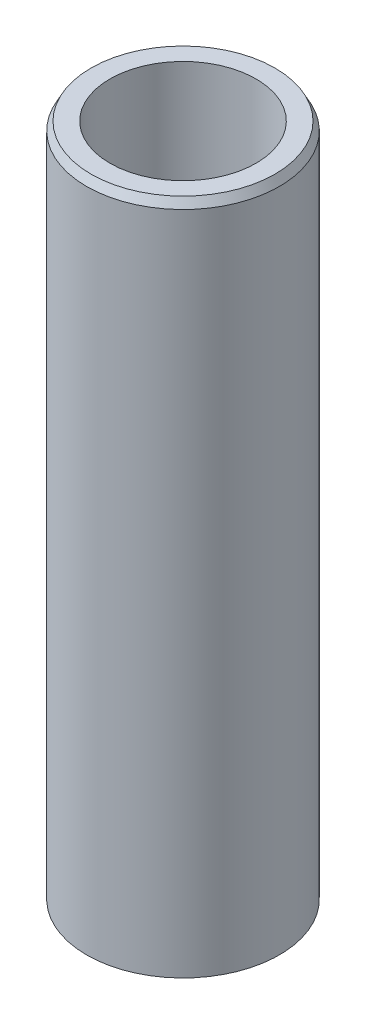
ISO-10303-21;
HEADER;
FILE_DESCRIPTION(('STEP AP214'),'2;1');
FILE_NAME('part.step','',(''),(''),'','','');
FILE_SCHEMA(('AUTOMOTIVE_DESIGN { 1 0 10303 214 1 1 1 1 }'));
ENDSEC;
DATA;
#1=APPLICATION_CONTEXT('core data for automotive mechanical design processes');
#2=APPLICATION_PROTOCOL_DEFINITION('international standard','automotive_design',2000,#1);
#3=PRODUCT_CONTEXT('',#1,'mechanical');
#4=PRODUCT('Part','Part','',(#3));
#5=PRODUCT_RELATED_PRODUCT_CATEGORY('part','',(#4));
#6=PRODUCT_DEFINITION_FORMATION('','',#4);
#7=PRODUCT_DEFINITION_CONTEXT('part definition',#1,'design');
#8=PRODUCT_DEFINITION('design','',#6,#7);
#9=PRODUCT_DEFINITION_SHAPE('','',#8);
#10=(LENGTH_UNIT() NAMED_UNIT(*) SI_UNIT(.MILLI.,.METRE.));
#11=(NAMED_UNIT(*) PLANE_ANGLE_UNIT() SI_UNIT($,.RADIAN.));
#12=(NAMED_UNIT(*) SI_UNIT($,.STERADIAN.) SOLID_ANGLE_UNIT());
#13=UNCERTAINTY_MEASURE_WITH_UNIT(LENGTH_MEASURE(1.E-05),#10,'distance_accuracy_value','');
#14=(GEOMETRIC_REPRESENTATION_CONTEXT(3) GLOBAL_UNCERTAINTY_ASSIGNED_CONTEXT((#13)) GLOBAL_UNIT_ASSIGNED_CONTEXT((#10,
#11,#12)) REPRESENTATION_CONTEXT('',''));
#15=CARTESIAN_POINT('',(0.,0.,0.));
#16=DIRECTION('',(0.,0.,1.));
#17=DIRECTION('',(1.,0.,0.));
#18=AXIS2_PLACEMENT_3D('',#15,#16,#17);
#19=CARTESIAN_POINT('',(0.,334.300783859886,0.));
#20=DIRECTION('',(0.,-1.,0.));
#21=DIRECTION('',(0.,0.,-1.));
#22=AXIS2_PLACEMENT_3D('',#19,#20,#21);
#23=CYLINDRICAL_SURFACE('',#22,47.5);
#24=CARTESIAN_POINT('',(0.,330.138083601052,0.));
#25=DIRECTION('',(0.,1.,0.));
#26=DIRECTION('',(0.,0.,1.));
#27=AXIS2_PLACEMENT_3D('',#24,#25,#26);
#28=CIRCLE('',#27,47.5);
#29=CARTESIAN_POINT('',(0.,330.138083601052,47.5));
#30=VERTEX_POINT('',#29);
#31=EDGE_CURVE('E50',#30,#30,#28,.F.);
#32=ORIENTED_EDGE('',*,*,#31,.T.);
#33=EDGE_LOOP('',(#32));
#34=FACE_BOUND('',#33,.T.);
#35=CARTESIAN_POINT('',(0.,2.18607595853532,0.));
#36=DIRECTION('',(0.,1.,0.));
#37=DIRECTION('',(0.,0.,1.));
#38=AXIS2_PLACEMENT_3D('',#35,#36,#37);
#39=CIRCLE('',#38,47.5);
#40=CARTESIAN_POINT('',(0.,2.18607595853532,47.5));
#41=VERTEX_POINT('',#40);
#42=EDGE_CURVE('E51',#41,#41,#39,.T.);
#43=ORIENTED_EDGE('',*,*,#42,.T.);
#44=EDGE_LOOP('',(#43));
#45=FACE_BOUND('',#44,.T.);
#46=ADVANCED_FACE('F39',(#34,#45),#23,.T.);
#47=CARTESIAN_POINT('',(0.,334.300783859886,0.));
#48=DIRECTION('',(0.,1.,0.));
#49=DIRECTION('',(0.,0.,1.));
#50=AXIS2_PLACEMENT_3D('',#47,#48,#49);
#51=PLANE('',#50);
#52=CARTESIAN_POINT('',(0.,334.300783859886,0.));
#53=DIRECTION('',(0.,1.,0.));
#54=DIRECTION('',(0.,0.,1.));
#55=AXIS2_PLACEMENT_3D('',#52,#53,#54);
#56=CIRCLE('',#55,45.3139240414647);
#57=CARTESIAN_POINT('',(0.,334.300783859886,45.3139240414647));
#58=VERTEX_POINT('',#57);
#59=EDGE_CURVE('E54',#58,#58,#56,.T.);
#60=ORIENTED_EDGE('',*,*,#59,.T.);
#61=EDGE_LOOP('',(#60));
#62=FACE_BOUND('',#61,.T.);
#63=CARTESIAN_POINT('',(0.,334.300783859886,0.));
#64=DIRECTION('',(0.,1.,0.));
#65=DIRECTION('',(0.,0.,1.));
#66=AXIS2_PLACEMENT_3D('',#63,#64,#65);
#67=CIRCLE('',#66,36.0100577323027);
#68=CARTESIAN_POINT('',(0.,334.300783859886,36.0100577323027));
#69=VERTEX_POINT('',#68);
#70=EDGE_CURVE('E58',#69,#69,#67,.T.);
#71=ORIENTED_EDGE('',*,*,#70,.F.);
#72=EDGE_LOOP('',(#71));
#73=FACE_BOUND('',#72,.T.);
#74=ADVANCED_FACE('F69',(#62,#73),#51,.T.);
#75=CARTESIAN_POINT('',(0.,0.,0.));
#76=DIRECTION('',(0.,1.,0.));
#77=DIRECTION('',(0.,0.,1.));
#78=AXIS2_PLACEMENT_3D('',#75,#76,#77);
#79=PLANE('',#78);
#80=CARTESIAN_POINT('',(0.,0.,0.));
#81=DIRECTION('',(0.,1.,0.));
#82=DIRECTION('',(0.,0.,1.));
#83=AXIS2_PLACEMENT_3D('',#80,#81,#82);
#84=CIRCLE('',#83,43.3372997411654);
#85=CARTESIAN_POINT('',(0.,0.,43.3372997411654));
#86=VERTEX_POINT('',#85);
#87=EDGE_CURVE('E10',#86,#86,#84,.F.);
#88=ORIENTED_EDGE('',*,*,#87,.T.);
#89=EDGE_LOOP('',(#88));
#90=FACE_BOUND('',#89,.T.);
#91=CARTESIAN_POINT('',(0.,0.,0.));
#92=DIRECTION('',(0.,1.,0.));
#93=DIRECTION('',(0.,0.,1.));
#94=AXIS2_PLACEMENT_3D('',#91,#92,#93);
#95=CIRCLE('',#94,36.0100577323027);
#96=CARTESIAN_POINT('',(0.,0.,36.0100577323027));
#97=VERTEX_POINT('',#96);
#98=EDGE_CURVE('E63',#97,#97,#95,.T.);
#99=ORIENTED_EDGE('',*,*,#98,.T.);
#100=EDGE_LOOP('',(#99));
#101=FACE_BOUND('',#100,.T.);
#102=ADVANCED_FACE('F75',(#90,#101),#79,.F.);
#103=CARTESIAN_POINT('',(0.,334.300783859886,0.));
#104=DIRECTION('',(0.,-1.,0.));
#105=DIRECTION('',(0.,0.,-1.));
#106=AXIS2_PLACEMENT_3D('',#103,#104,#105);
#107=CYLINDRICAL_SURFACE('',#106,36.0100577323027);
#108=ORIENTED_EDGE('',*,*,#70,.T.);
#109=EDGE_LOOP('',(#108));
#110=FACE_BOUND('',#109,.T.);
#111=ORIENTED_EDGE('',*,*,#98,.F.);
#112=EDGE_LOOP('',(#111));
#113=FACE_BOUND('',#112,.T.);
#114=ADVANCED_FACE('F70',(#110,#113),#107,.F.);
#115=CARTESIAN_POINT('',(0.,334.300783859886,0.));
#116=DIRECTION('',(0.,-1.,0.));
#117=DIRECTION('',(0.,0.,-1.));
#118=AXIS2_PLACEMENT_3D('',#115,#116,#117);
#119=CONICAL_SURFACE('',#118,45.3139240414647,0.483570970357964);
#120=ORIENTED_EDGE('',*,*,#31,.F.);
#121=EDGE_LOOP('',(#120));
#122=FACE_BOUND('',#121,.T.);
#123=ORIENTED_EDGE('',*,*,#59,.F.);
#124=EDGE_LOOP('',(#123));
#125=FACE_BOUND('',#124,.T.);
#126=ADVANCED_FACE('F81',(#122,#125),#119,.T.);
#127=CARTESIAN_POINT('',(0.,2.18607595853532,0.));
#128=DIRECTION('',(0.,1.,0.));
#129=DIRECTION('',(0.,0.,1.));
#130=AXIS2_PLACEMENT_3D('',#127,#128,#129);
#131=CONICAL_SURFACE('',#130,47.5,1.08722535643693);
#132=ORIENTED_EDGE('',*,*,#87,.F.);
#133=EDGE_LOOP('',(#132));
#134=FACE_BOUND('',#133,.T.);
#135=ORIENTED_EDGE('',*,*,#42,.F.);
#136=EDGE_LOOP('',(#135));
#137=FACE_BOUND('',#136,.T.);
#138=ADVANCED_FACE('F45',(#134,#137),#131,.T.);
#139=CLOSED_SHELL('',(#46,#74,#102,#114,#126,#138));
#140=MANIFOLD_SOLID_BREP('B2',#139);
#141=ADVANCED_BREP_SHAPE_REPRESENTATION('',(#18,#140),#14);
#142=SHAPE_DEFINITION_REPRESENTATION(#9,#141);
ENDSEC;
END-ISO-10303-21;
